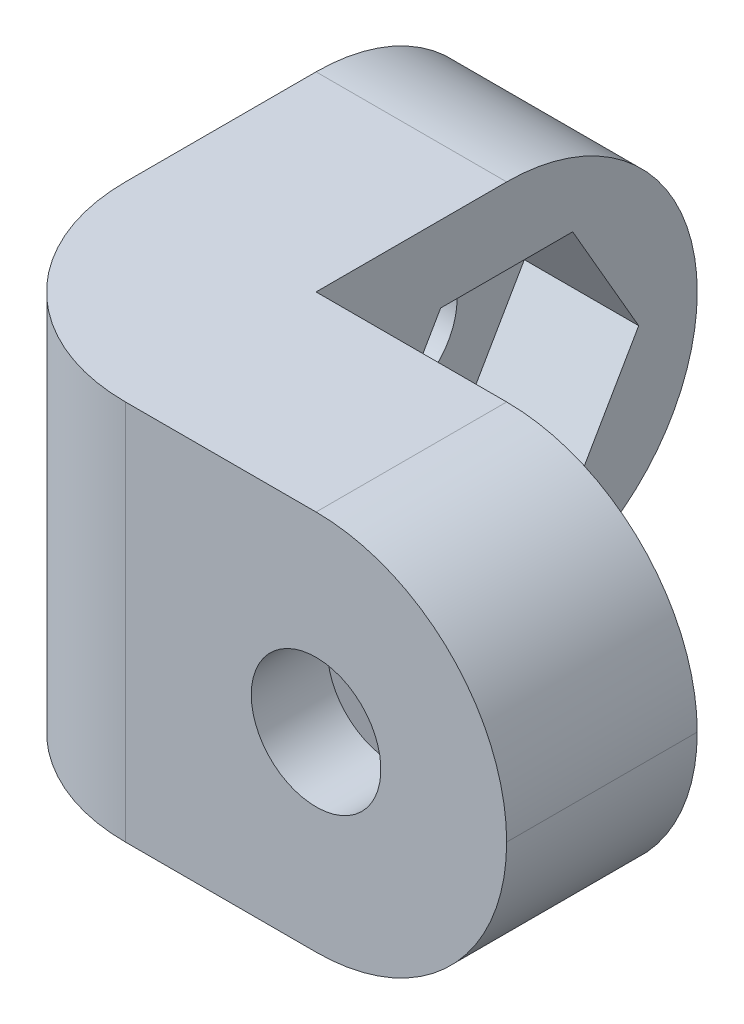
ISO-10303-21;
HEADER;
FILE_DESCRIPTION(('STEP AP214'),'2;1');
FILE_NAME('part.step','',(''),(''),'','','');
FILE_SCHEMA(('AUTOMOTIVE_DESIGN { 1 0 10303 214 1 1 1 1 }'));
ENDSEC;
DATA;
#1=APPLICATION_CONTEXT('core data for automotive mechanical design processes');
#2=APPLICATION_PROTOCOL_DEFINITION('international standard','automotive_design',2000,#1);
#3=PRODUCT_CONTEXT('',#1,'mechanical');
#4=PRODUCT('Part','Part','',(#3));
#5=PRODUCT_RELATED_PRODUCT_CATEGORY('part','',(#4));
#6=PRODUCT_DEFINITION_FORMATION('','',#4);
#7=PRODUCT_DEFINITION_CONTEXT('part definition',#1,'design');
#8=PRODUCT_DEFINITION('design','',#6,#7);
#9=PRODUCT_DEFINITION_SHAPE('','',#8);
#10=(LENGTH_UNIT() NAMED_UNIT(*) SI_UNIT(.MILLI.,.METRE.));
#11=(NAMED_UNIT(*) PLANE_ANGLE_UNIT() SI_UNIT($,.RADIAN.));
#12=(NAMED_UNIT(*) SI_UNIT($,.STERADIAN.) SOLID_ANGLE_UNIT());
#13=UNCERTAINTY_MEASURE_WITH_UNIT(LENGTH_MEASURE(1.E-05),#10,'distance_accuracy_value','');
#14=(GEOMETRIC_REPRESENTATION_CONTEXT(3) GLOBAL_UNCERTAINTY_ASSIGNED_CONTEXT((#13)) GLOBAL_UNIT_ASSIGNED_CONTEXT((#10,
#11,#12)) REPRESENTATION_CONTEXT('',''));
#15=CARTESIAN_POINT('',(0.,0.,0.));
#16=DIRECTION('',(0.,0.,1.));
#17=DIRECTION('',(1.,0.,0.));
#18=AXIS2_PLACEMENT_3D('',#15,#16,#17);
#19=CARTESIAN_POINT('',(10.,5.,0.));
#20=DIRECTION('',(0.,0.,-1.));
#21=DIRECTION('',(-1.,0.,0.));
#22=AXIS2_PLACEMENT_3D('',#19,#20,#21);
#23=CYLINDRICAL_SURFACE('',#22,1.7);
#24=CARTESIAN_POINT('',(10.,5.,0.));
#25=DIRECTION('',(0.,0.,-1.));
#26=DIRECTION('',(-1.,0.,0.));
#27=AXIS2_PLACEMENT_3D('',#24,#25,#26);
#28=CIRCLE('',#27,1.7);
#29=CARTESIAN_POINT('',(8.3,5.,0.));
#30=VERTEX_POINT('',#29);
#31=EDGE_CURVE('E290',#30,#30,#28,.T.);
#32=ORIENTED_EDGE('',*,*,#31,.F.);
#33=EDGE_LOOP('',(#32));
#34=FACE_BOUND('',#33,.T.);
#35=CARTESIAN_POINT('',(10.,5.,-2.));
#36=DIRECTION('',(0.,0.,-1.));
#37=DIRECTION('',(-1.,0.,0.));
#38=AXIS2_PLACEMENT_3D('',#35,#36,#37);
#39=CIRCLE('',#38,1.7);
#40=CARTESIAN_POINT('',(8.3,5.,-2.));
#41=VERTEX_POINT('',#40);
#42=EDGE_CURVE('E230',#41,#41,#39,.F.);
#43=ORIENTED_EDGE('',*,*,#42,.F.);
#44=EDGE_LOOP('',(#43));
#45=FACE_BOUND('',#44,.T.);
#46=ADVANCED_FACE('F34',(#34,#45),#23,.F.);
#47=CARTESIAN_POINT('',(0.,5.,-10.));
#48=DIRECTION('',(1.,0.,0.));
#49=DIRECTION('',(0.,0.,-1.));
#50=AXIS2_PLACEMENT_3D('',#47,#48,#49);
#51=CYLINDRICAL_SURFACE('',#50,1.7);
#52=CARTESIAN_POINT('',(0.,5.,-10.));
#53=DIRECTION('',(1.,0.,0.));
#54=DIRECTION('',(0.,0.,-1.));
#55=AXIS2_PLACEMENT_3D('',#52,#53,#54);
#56=CIRCLE('',#55,1.7);
#57=CARTESIAN_POINT('',(0.,5.,-11.7));
#58=VERTEX_POINT('',#57);
#59=EDGE_CURVE('E287',#58,#58,#56,.T.);
#60=ORIENTED_EDGE('',*,*,#59,.F.);
#61=EDGE_LOOP('',(#60));
#62=FACE_BOUND('',#61,.T.);
#63=CARTESIAN_POINT('',(2.,5.,-10.));
#64=DIRECTION('',(1.,0.,0.));
#65=DIRECTION('',(0.,0.,-1.));
#66=AXIS2_PLACEMENT_3D('',#63,#64,#65);
#67=CIRCLE('',#66,1.7);
#68=CARTESIAN_POINT('',(2.,5.,-11.7));
#69=VERTEX_POINT('',#68);
#70=EDGE_CURVE('E276',#69,#69,#67,.F.);
#71=ORIENTED_EDGE('',*,*,#70,.F.);
#72=EDGE_LOOP('',(#71));
#73=FACE_BOUND('',#72,.T.);
#74=ADVANCED_FACE('F402',(#62,#73),#51,.F.);
#75=CARTESIAN_POINT('',(0.,10.,0.));
#76=DIRECTION('',(0.,0.,-1.));
#77=DIRECTION('',(-1.,0.,0.));
#78=AXIS2_PLACEMENT_3D('',#75,#76,#77);
#79=PLANE('',#78);
#80=ORIENTED_EDGE('',*,*,#31,.T.);
#81=EDGE_LOOP('',(#80));
#82=FACE_BOUND('',#81,.T.);
#83=DIRECTION('',(1.,0.,0.));
#84=VECTOR('',#83,1.);
#85=CARTESIAN_POINT('',(0.,10.,0.));
#86=LINE('',#85,#84);
#87=CARTESIAN_POINT('',(5.,10.,0.));
#88=VERTEX_POINT('',#87);
#89=CARTESIAN_POINT('',(10.,10.,0.));
#90=VERTEX_POINT('',#89);
#91=EDGE_CURVE('E294',#88,#90,#86,.T.);
#92=ORIENTED_EDGE('',*,*,#91,.F.);
#93=DIRECTION('',(0.,-1.,0.));
#94=VECTOR('',#93,1.);
#95=CARTESIAN_POINT('',(5.,10.,0.));
#96=LINE('',#95,#94);
#97=CARTESIAN_POINT('',(5.,0.,0.));
#98=VERTEX_POINT('',#97);
#99=EDGE_CURVE('E325',#88,#98,#96,.T.);
#100=ORIENTED_EDGE('',*,*,#99,.T.);
#101=DIRECTION('',(1.,0.,0.));
#102=VECTOR('',#101,1.);
#103=CARTESIAN_POINT('',(0.,0.,0.));
#104=LINE('',#103,#102);
#105=CARTESIAN_POINT('',(10.,0.,0.));
#106=VERTEX_POINT('',#105);
#107=EDGE_CURVE('E293',#98,#106,#104,.T.);
#108=ORIENTED_EDGE('',*,*,#107,.T.);
#109=CARTESIAN_POINT('',(10.,5.,0.));
#110=DIRECTION('',(0.,0.,-1.));
#111=DIRECTION('',(-1.,0.,0.));
#112=AXIS2_PLACEMENT_3D('',#109,#110,#111);
#113=CIRCLE('',#112,5.);
#114=CARTESIAN_POINT('',(15.,5.,0.));
#115=VERTEX_POINT('',#114);
#116=EDGE_CURVE('E317',#106,#115,#113,.F.);
#117=ORIENTED_EDGE('',*,*,#116,.T.);
#118=CARTESIAN_POINT('',(10.,5.,0.));
#119=DIRECTION('',(0.,0.,-1.));
#120=DIRECTION('',(-1.,0.,0.));
#121=AXIS2_PLACEMENT_3D('',#118,#119,#120);
#122=CIRCLE('',#121,5.);
#123=EDGE_CURVE('E323',#115,#90,#122,.F.);
#124=ORIENTED_EDGE('',*,*,#123,.T.);
#125=EDGE_LOOP('',(#92,#100,#108,#117,#124));
#126=FACE_BOUND('',#125,.T.);
#127=ADVANCED_FACE('F388',(#82,#126),#79,.F.);
#128=CARTESIAN_POINT('',(15.,10.,-5.));
#129=DIRECTION('',(0.,0.,1.));
#130=DIRECTION('',(1.,0.,0.));
#131=AXIS2_PLACEMENT_3D('',#128,#129,#130);
#132=PLANE('',#131);
#133=DIRECTION('',(0.5,0.866025403784439,0.));
#134=VECTOR('',#133,1.);
#135=CARTESIAN_POINT('',(6.53589838486224,5.,-5.));
#136=LINE('',#135,#134);
#137=CARTESIAN_POINT('',(6.53589838486225,5.,-5.));
#138=VERTEX_POINT('',#137);
#139=CARTESIAN_POINT('',(8.26794919243112,8.,-5.));
#140=VERTEX_POINT('',#139);
#141=EDGE_CURVE('E217',#138,#140,#136,.T.);
#142=ORIENTED_EDGE('',*,*,#141,.F.);
#143=DIRECTION('',(-0.5,0.866025403784439,0.));
#144=VECTOR('',#143,1.);
#145=CARTESIAN_POINT('',(8.26794919243112,2.,-5.));
#146=LINE('',#145,#144);
#147=CARTESIAN_POINT('',(8.26794919243112,2.,-5.));
#148=VERTEX_POINT('',#147);
#149=EDGE_CURVE('E184',#148,#138,#146,.T.);
#150=ORIENTED_EDGE('',*,*,#149,.F.);
#151=DIRECTION('',(-1.,0.,0.));
#152=VECTOR('',#151,1.);
#153=CARTESIAN_POINT('',(11.7320508075689,2.,-5.));
#154=LINE('',#153,#152);
#155=CARTESIAN_POINT('',(11.7320508075689,2.,-5.));
#156=VERTEX_POINT('',#155);
#157=EDGE_CURVE('E203',#156,#148,#154,.T.);
#158=ORIENTED_EDGE('',*,*,#157,.F.);
#159=DIRECTION('',(-0.5,-0.866025403784439,0.));
#160=VECTOR('',#159,1.);
#161=CARTESIAN_POINT('',(13.4641016151378,5.,-5.));
#162=LINE('',#161,#160);
#163=CARTESIAN_POINT('',(13.4641016151378,5.,-5.));
#164=VERTEX_POINT('',#163);
#165=EDGE_CURVE('E206',#164,#156,#162,.T.);
#166=ORIENTED_EDGE('',*,*,#165,.F.);
#167=DIRECTION('',(0.5,-0.866025403784439,0.));
#168=VECTOR('',#167,1.);
#169=CARTESIAN_POINT('',(11.7320508075689,8.,-5.));
#170=LINE('',#169,#168);
#171=CARTESIAN_POINT('',(11.7320508075689,8.,-5.));
#172=VERTEX_POINT('',#171);
#173=EDGE_CURVE('E223',#172,#164,#170,.T.);
#174=ORIENTED_EDGE('',*,*,#173,.F.);
#175=DIRECTION('',(1.,0.,0.));
#176=VECTOR('',#175,1.);
#177=CARTESIAN_POINT('',(8.26794919243112,8.,-5.));
#178=LINE('',#177,#176);
#179=EDGE_CURVE('E220',#140,#172,#178,.T.);
#180=ORIENTED_EDGE('',*,*,#179,.F.);
#181=EDGE_LOOP('',(#142,#150,#158,#166,#174,#180));
#182=FACE_BOUND('',#181,.T.);
#183=DIRECTION('',(-1.,0.,0.));
#184=VECTOR('',#183,1.);
#185=CARTESIAN_POINT('',(15.,10.,-5.));
#186=LINE('',#185,#184);
#187=CARTESIAN_POINT('',(10.,10.,-5.));
#188=VERTEX_POINT('',#187);
#189=CARTESIAN_POINT('',(5.,10.,-5.));
#190=VERTEX_POINT('',#189);
#191=EDGE_CURVE('E297',#188,#190,#186,.T.);
#192=ORIENTED_EDGE('',*,*,#191,.F.);
#193=CARTESIAN_POINT('',(10.,5.,-5.));
#194=DIRECTION('',(0.,0.,1.));
#195=DIRECTION('',(1.,0.,0.));
#196=AXIS2_PLACEMENT_3D('',#193,#194,#195);
#197=CIRCLE('',#196,5.);
#198=CARTESIAN_POINT('',(15.,5.,-5.));
#199=VERTEX_POINT('',#198);
#200=EDGE_CURVE('E57',#188,#199,#197,.F.);
#201=ORIENTED_EDGE('',*,*,#200,.T.);
#202=CARTESIAN_POINT('',(10.,5.,-5.));
#203=DIRECTION('',(0.,0.,1.));
#204=DIRECTION('',(1.,0.,0.));
#205=AXIS2_PLACEMENT_3D('',#202,#203,#204);
#206=CIRCLE('',#205,5.);
#207=CARTESIAN_POINT('',(10.,0.,-5.));
#208=VERTEX_POINT('',#207);
#209=EDGE_CURVE('E348',#199,#208,#206,.F.);
#210=ORIENTED_EDGE('',*,*,#209,.T.);
#211=DIRECTION('',(-1.,0.,0.));
#212=VECTOR('',#211,1.);
#213=CARTESIAN_POINT('',(15.,0.,-5.));
#214=LINE('',#213,#212);
#215=CARTESIAN_POINT('',(5.,0.,-5.));
#216=VERTEX_POINT('',#215);
#217=EDGE_CURVE('E309',#208,#216,#214,.T.);
#218=ORIENTED_EDGE('',*,*,#217,.T.);
#219=DIRECTION('',(0.,-1.,0.));
#220=VECTOR('',#219,1.);
#221=CARTESIAN_POINT('',(5.,10.,-5.));
#222=LINE('',#221,#220);
#223=EDGE_CURVE('E306',#190,#216,#222,.T.);
#224=ORIENTED_EDGE('',*,*,#223,.F.);
#225=EDGE_LOOP('',(#192,#201,#210,#218,#224));
#226=FACE_BOUND('',#225,.T.);
#227=ADVANCED_FACE('F371',(#182,#226),#132,.F.);
#228=CARTESIAN_POINT('',(5.,10.,-5.));
#229=DIRECTION('',(-1.,0.,0.));
#230=DIRECTION('',(0.,0.,1.));
#231=AXIS2_PLACEMENT_3D('',#228,#229,#230);
#232=PLANE('',#231);
#233=DIRECTION('',(0.,0.866025403784439,0.5));
#234=VECTOR('',#233,1.);
#235=CARTESIAN_POINT('',(5.,5.,-13.4641016151378));
#236=LINE('',#235,#234);
#237=CARTESIAN_POINT('',(5.,5.,-13.4641016151378));
#238=VERTEX_POINT('',#237);
#239=CARTESIAN_POINT('',(5.,8.,-11.7320508075689));
#240=VERTEX_POINT('',#239);
#241=EDGE_CURVE('E260',#238,#240,#236,.T.);
#242=ORIENTED_EDGE('',*,*,#241,.F.);
#243=DIRECTION('',(0.,0.866025403784439,-0.5));
#244=VECTOR('',#243,1.);
#245=CARTESIAN_POINT('',(5.,2.,-11.7320508075689));
#246=LINE('',#245,#244);
#247=CARTESIAN_POINT('',(5.,2.,-11.7320508075689));
#248=VERTEX_POINT('',#247);
#249=EDGE_CURVE('E258',#248,#238,#246,.T.);
#250=ORIENTED_EDGE('',*,*,#249,.F.);
#251=DIRECTION('',(0.,0.,-1.));
#252=VECTOR('',#251,1.);
#253=CARTESIAN_POINT('',(5.,2.,-8.26794919243112));
#254=LINE('',#253,#252);
#255=CARTESIAN_POINT('',(5.,2.,-8.26794919243112));
#256=VERTEX_POINT('',#255);
#257=EDGE_CURVE('E242',#256,#248,#254,.T.);
#258=ORIENTED_EDGE('',*,*,#257,.F.);
#259=DIRECTION('',(0.,-0.866025403784439,-0.5));
#260=VECTOR('',#259,1.);
#261=CARTESIAN_POINT('',(5.,5.,-6.53589838486225));
#262=LINE('',#261,#260);
#263=CARTESIAN_POINT('',(5.,5.,-6.53589838486225));
#264=VERTEX_POINT('',#263);
#265=EDGE_CURVE('E269',#264,#256,#262,.T.);
#266=ORIENTED_EDGE('',*,*,#265,.F.);
#267=DIRECTION('',(0.,-0.866025403784439,0.5));
#268=VECTOR('',#267,1.);
#269=CARTESIAN_POINT('',(5.,8.,-8.26794919243112));
#270=LINE('',#269,#268);
#271=CARTESIAN_POINT('',(5.,8.,-8.26794919243112));
#272=VERTEX_POINT('',#271);
#273=EDGE_CURVE('E266',#272,#264,#270,.T.);
#274=ORIENTED_EDGE('',*,*,#273,.F.);
#275=DIRECTION('',(0.,0.,1.));
#276=VECTOR('',#275,1.);
#277=CARTESIAN_POINT('',(5.,8.,-11.7320508075689));
#278=LINE('',#277,#276);
#279=EDGE_CURVE('E263',#240,#272,#278,.T.);
#280=ORIENTED_EDGE('',*,*,#279,.F.);
#281=EDGE_LOOP('',(#242,#250,#258,#266,#274,#280));
#282=FACE_BOUND('',#281,.T.);
#283=DIRECTION('',(0.,0.,-1.));
#284=VECTOR('',#283,1.);
#285=CARTESIAN_POINT('',(5.,0.,-5.));
#286=LINE('',#285,#284);
#287=CARTESIAN_POINT('',(5.,0.,-10.));
#288=VERTEX_POINT('',#287);
#289=EDGE_CURVE('E311',#216,#288,#286,.T.);
#290=ORIENTED_EDGE('',*,*,#289,.T.);
#291=CARTESIAN_POINT('',(5.,5.,-10.));
#292=DIRECTION('',(-1.,0.,0.));
#293=DIRECTION('',(0.,0.,1.));
#294=AXIS2_PLACEMENT_3D('',#291,#292,#293);
#295=CIRCLE('',#294,5.);
#296=CARTESIAN_POINT('',(5.,5.,-15.));
#297=VERTEX_POINT('',#296);
#298=EDGE_CURVE('E11',#288,#297,#295,.F.);
#299=ORIENTED_EDGE('',*,*,#298,.T.);
#300=CARTESIAN_POINT('',(5.,5.,-10.));
#301=DIRECTION('',(-1.,0.,0.));
#302=DIRECTION('',(0.,0.,1.));
#303=AXIS2_PLACEMENT_3D('',#300,#301,#302);
#304=CIRCLE('',#303,5.);
#305=CARTESIAN_POINT('',(5.,10.,-10.));
#306=VERTEX_POINT('',#305);
#307=EDGE_CURVE('E43',#297,#306,#304,.F.);
#308=ORIENTED_EDGE('',*,*,#307,.T.);
#309=DIRECTION('',(0.,0.,-1.));
#310=VECTOR('',#309,1.);
#311=CARTESIAN_POINT('',(5.,10.,-5.));
#312=LINE('',#311,#310);
#313=EDGE_CURVE('E300',#190,#306,#312,.T.);
#314=ORIENTED_EDGE('',*,*,#313,.F.);
#315=ORIENTED_EDGE('',*,*,#223,.T.);
#316=EDGE_LOOP('',(#290,#299,#308,#314,#315));
#317=FACE_BOUND('',#316,.T.);
#318=ADVANCED_FACE('F365',(#282,#317),#232,.F.);
#319=CARTESIAN_POINT('',(0.,10.,0.));
#320=DIRECTION('',(1.,0.,0.));
#321=DIRECTION('',(0.,0.,-1.));
#322=AXIS2_PLACEMENT_3D('',#319,#320,#321);
#323=PLANE('',#322);
#324=ORIENTED_EDGE('',*,*,#59,.T.);
#325=EDGE_LOOP('',(#324));
#326=FACE_BOUND('',#325,.T.);
#327=DIRECTION('',(0.,0.,1.));
#328=VECTOR('',#327,1.);
#329=CARTESIAN_POINT('',(0.,0.,0.));
#330=LINE('',#329,#328);
#331=CARTESIAN_POINT('',(0.,0.,-10.));
#332=VERTEX_POINT('',#331);
#333=CARTESIAN_POINT('',(0.,0.,-5.));
#334=VERTEX_POINT('',#333);
#335=EDGE_CURVE('E298',#332,#334,#330,.T.);
#336=ORIENTED_EDGE('',*,*,#335,.T.);
#337=DIRECTION('',(0.,-1.,0.));
#338=VECTOR('',#337,1.);
#339=CARTESIAN_POINT('',(0.,10.,-5.));
#340=LINE('',#339,#338);
#341=CARTESIAN_POINT('',(0.,10.,-5.));
#342=VERTEX_POINT('',#341);
#343=EDGE_CURVE('E339',#334,#342,#340,.F.);
#344=ORIENTED_EDGE('',*,*,#343,.T.);
#345=DIRECTION('',(0.,0.,1.));
#346=VECTOR('',#345,1.);
#347=CARTESIAN_POINT('',(0.,10.,0.));
#348=LINE('',#347,#346);
#349=CARTESIAN_POINT('',(0.,10.,-10.));
#350=VERTEX_POINT('',#349);
#351=EDGE_CURVE('E303',#350,#342,#348,.T.);
#352=ORIENTED_EDGE('',*,*,#351,.F.);
#353=CARTESIAN_POINT('',(0.,5.,-10.));
#354=DIRECTION('',(1.,0.,0.));
#355=DIRECTION('',(0.,0.,-1.));
#356=AXIS2_PLACEMENT_3D('',#353,#354,#355);
#357=CIRCLE('',#356,5.);
#358=CARTESIAN_POINT('',(0.,5.,-15.));
#359=VERTEX_POINT('',#358);
#360=EDGE_CURVE('E335',#350,#359,#357,.F.);
#361=ORIENTED_EDGE('',*,*,#360,.T.);
#362=CARTESIAN_POINT('',(0.,5.,-10.));
#363=DIRECTION('',(1.,0.,0.));
#364=DIRECTION('',(0.,0.,-1.));
#365=AXIS2_PLACEMENT_3D('',#362,#363,#364);
#366=CIRCLE('',#365,5.);
#367=EDGE_CURVE('E337',#359,#332,#366,.F.);
#368=ORIENTED_EDGE('',*,*,#367,.T.);
#369=EDGE_LOOP('',(#336,#344,#352,#361,#368));
#370=FACE_BOUND('',#369,.T.);
#371=ADVANCED_FACE('F381',(#326,#370),#323,.F.);
#372=CARTESIAN_POINT('',(0.,10.,0.));
#373=DIRECTION('',(0.,1.,0.));
#374=DIRECTION('',(0.,0.,1.));
#375=AXIS2_PLACEMENT_3D('',#372,#373,#374);
#376=PLANE('',#375);
#377=ORIENTED_EDGE('',*,*,#351,.T.);
#378=CARTESIAN_POINT('',(5.,10.,-5.));
#379=DIRECTION('',(0.,1.,0.));
#380=DIRECTION('',(0.,0.,1.));
#381=AXIS2_PLACEMENT_3D('',#378,#379,#380);
#382=CIRCLE('',#381,5.);
#383=EDGE_CURVE('E346',#342,#88,#382,.T.);
#384=ORIENTED_EDGE('',*,*,#383,.T.);
#385=ORIENTED_EDGE('',*,*,#91,.T.);
#386=DIRECTION('',(0.,0.,-1.));
#387=VECTOR('',#386,1.);
#388=CARTESIAN_POINT('',(10.,10.,-5.));
#389=LINE('',#388,#387);
#390=EDGE_CURVE('E343',#90,#188,#389,.T.);
#391=ORIENTED_EDGE('',*,*,#390,.T.);
#392=ORIENTED_EDGE('',*,*,#191,.T.);
#393=ORIENTED_EDGE('',*,*,#313,.T.);
#394=DIRECTION('',(-1.,0.,0.));
#395=VECTOR('',#394,1.);
#396=CARTESIAN_POINT('',(0.,10.,-10.));
#397=LINE('',#396,#395);
#398=EDGE_CURVE('E341',#306,#350,#397,.T.);
#399=ORIENTED_EDGE('',*,*,#398,.T.);
#400=EDGE_LOOP('',(#377,#384,#385,#391,#392,#393,#399));
#401=FACE_BOUND('',#400,.T.);
#402=ADVANCED_FACE('F367',(#401),#376,.T.);
#403=CARTESIAN_POINT('',(0.,0.,0.));
#404=DIRECTION('',(0.,1.,0.));
#405=DIRECTION('',(0.,0.,1.));
#406=AXIS2_PLACEMENT_3D('',#403,#404,#405);
#407=PLANE('',#406);
#408=ORIENTED_EDGE('',*,*,#107,.F.);
#409=CARTESIAN_POINT('',(5.,0.,-5.));
#410=DIRECTION('',(0.,1.,0.));
#411=DIRECTION('',(0.,0.,1.));
#412=AXIS2_PLACEMENT_3D('',#409,#410,#411);
#413=CIRCLE('',#412,5.);
#414=EDGE_CURVE('E333',#98,#334,#413,.F.);
#415=ORIENTED_EDGE('',*,*,#414,.T.);
#416=ORIENTED_EDGE('',*,*,#335,.F.);
#417=DIRECTION('',(-1.,0.,0.));
#418=VECTOR('',#417,1.);
#419=CARTESIAN_POINT('',(0.,0.,-10.));
#420=LINE('',#419,#418);
#421=EDGE_CURVE('E328',#332,#288,#420,.F.);
#422=ORIENTED_EDGE('',*,*,#421,.T.);
#423=ORIENTED_EDGE('',*,*,#289,.F.);
#424=ORIENTED_EDGE('',*,*,#217,.F.);
#425=DIRECTION('',(0.,0.,-1.));
#426=VECTOR('',#425,1.);
#427=CARTESIAN_POINT('',(10.,0.,0.));
#428=LINE('',#427,#426);
#429=EDGE_CURVE('E331',#208,#106,#428,.F.);
#430=ORIENTED_EDGE('',*,*,#429,.T.);
#431=EDGE_LOOP('',(#408,#415,#416,#422,#423,#424,#430));
#432=FACE_BOUND('',#431,.T.);
#433=ADVANCED_FACE('F376',(#432),#407,.F.);
#434=CARTESIAN_POINT('',(2.,0.,0.));
#435=DIRECTION('',(1.,0.,0.));
#436=DIRECTION('',(0.,0.,-1.));
#437=AXIS2_PLACEMENT_3D('',#434,#435,#436);
#438=PLANE('',#437);
#439=DIRECTION('',(0.,0.866025403784439,-0.5));
#440=VECTOR('',#439,1.);
#441=CARTESIAN_POINT('',(2.,2.,-11.7320508075689));
#442=LINE('',#441,#440);
#443=CARTESIAN_POINT('',(2.,2.,-11.7320508075689));
#444=VERTEX_POINT('',#443);
#445=CARTESIAN_POINT('',(2.,5.,-13.4641016151378));
#446=VERTEX_POINT('',#445);
#447=EDGE_CURVE('E238',#444,#446,#442,.T.);
#448=ORIENTED_EDGE('',*,*,#447,.T.);
#449=DIRECTION('',(0.,0.866025403784439,0.5));
#450=VECTOR('',#449,1.);
#451=CARTESIAN_POINT('',(2.,5.,-13.4641016151378));
#452=LINE('',#451,#450);
#453=CARTESIAN_POINT('',(2.,8.,-11.7320508075689));
#454=VERTEX_POINT('',#453);
#455=EDGE_CURVE('E241',#446,#454,#452,.T.);
#456=ORIENTED_EDGE('',*,*,#455,.T.);
#457=DIRECTION('',(0.,0.,1.));
#458=VECTOR('',#457,1.);
#459=CARTESIAN_POINT('',(2.,8.,-11.7320508075689));
#460=LINE('',#459,#458);
#461=CARTESIAN_POINT('',(2.,8.,-8.26794919243112));
#462=VERTEX_POINT('',#461);
#463=EDGE_CURVE('E245',#454,#462,#460,.T.);
#464=ORIENTED_EDGE('',*,*,#463,.T.);
#465=DIRECTION('',(0.,-0.866025403784439,0.5));
#466=VECTOR('',#465,1.);
#467=CARTESIAN_POINT('',(2.,8.,-8.26794919243112));
#468=LINE('',#467,#466);
#469=CARTESIAN_POINT('',(2.,5.,-6.53589838486225));
#470=VERTEX_POINT('',#469);
#471=EDGE_CURVE('E248',#462,#470,#468,.T.);
#472=ORIENTED_EDGE('',*,*,#471,.T.);
#473=DIRECTION('',(0.,-0.866025403784439,-0.5));
#474=VECTOR('',#473,1.);
#475=CARTESIAN_POINT('',(2.,5.,-6.53589838486225));
#476=LINE('',#475,#474);
#477=CARTESIAN_POINT('',(2.,2.,-8.26794919243112));
#478=VERTEX_POINT('',#477);
#479=EDGE_CURVE('E251',#470,#478,#476,.T.);
#480=ORIENTED_EDGE('',*,*,#479,.T.);
#481=DIRECTION('',(0.,0.,-1.));
#482=VECTOR('',#481,1.);
#483=CARTESIAN_POINT('',(2.,2.,-8.26794919243112));
#484=LINE('',#483,#482);
#485=EDGE_CURVE('E254',#478,#444,#484,.T.);
#486=ORIENTED_EDGE('',*,*,#485,.T.);
#487=EDGE_LOOP('',(#448,#456,#464,#472,#480,#486));
#488=FACE_BOUND('',#487,.T.);
#489=ORIENTED_EDGE('',*,*,#70,.T.);
#490=EDGE_LOOP('',(#489));
#491=FACE_BOUND('',#490,.T.);
#492=ADVANCED_FACE('F418',(#488,#491),#438,.T.);
#493=CARTESIAN_POINT('',(2.,2.,-11.7320508075689));
#494=DIRECTION('',(0.,-0.5,-0.866025403784439));
#495=DIRECTION('',(0.,0.866025403784439,-0.5));
#496=AXIS2_PLACEMENT_3D('',#493,#494,#495);
#497=PLANE('',#496);
#498=ORIENTED_EDGE('',*,*,#249,.T.);
#499=DIRECTION('',(1.,0.,0.));
#500=VECTOR('',#499,1.);
#501=CARTESIAN_POINT('',(2.,5.,-13.4641016151378));
#502=LINE('',#501,#500);
#503=EDGE_CURVE('E257',#446,#238,#502,.T.);
#504=ORIENTED_EDGE('',*,*,#503,.F.);
#505=ORIENTED_EDGE('',*,*,#447,.F.);
#506=DIRECTION('',(1.,0.,0.));
#507=VECTOR('',#506,1.);
#508=CARTESIAN_POINT('',(2.,2.,-11.7320508075689));
#509=LINE('',#508,#507);
#510=EDGE_CURVE('E274',#444,#248,#509,.T.);
#511=ORIENTED_EDGE('',*,*,#510,.T.);
#512=EDGE_LOOP('',(#498,#504,#505,#511));
#513=FACE_BOUND('',#512,.T.);
#514=ADVANCED_FACE('F449',(#513),#497,.F.);
#515=CARTESIAN_POINT('',(2.,2.,-8.26794919243112));
#516=DIRECTION('',(0.,-1.,0.));
#517=DIRECTION('',(0.,0.,-1.));
#518=AXIS2_PLACEMENT_3D('',#515,#516,#517);
#519=PLANE('',#518);
#520=ORIENTED_EDGE('',*,*,#257,.T.);
#521=ORIENTED_EDGE('',*,*,#510,.F.);
#522=ORIENTED_EDGE('',*,*,#485,.F.);
#523=DIRECTION('',(1.,0.,0.));
#524=VECTOR('',#523,1.);
#525=CARTESIAN_POINT('',(2.,2.,-8.26794919243112));
#526=LINE('',#525,#524);
#527=EDGE_CURVE('E277',#478,#256,#526,.T.);
#528=ORIENTED_EDGE('',*,*,#527,.T.);
#529=EDGE_LOOP('',(#520,#521,#522,#528));
#530=FACE_BOUND('',#529,.T.);
#531=ADVANCED_FACE('F451',(#530),#519,.F.);
#532=CARTESIAN_POINT('',(2.,5.,-6.53589838486225));
#533=DIRECTION('',(0.,-0.5,0.866025403784439));
#534=DIRECTION('',(0.,-0.866025403784439,-0.5));
#535=AXIS2_PLACEMENT_3D('',#532,#533,#534);
#536=PLANE('',#535);
#537=ORIENTED_EDGE('',*,*,#265,.T.);
#538=ORIENTED_EDGE('',*,*,#527,.F.);
#539=ORIENTED_EDGE('',*,*,#479,.F.);
#540=DIRECTION('',(1.,0.,0.));
#541=VECTOR('',#540,1.);
#542=CARTESIAN_POINT('',(2.,5.,-6.53589838486225));
#543=LINE('',#542,#541);
#544=EDGE_CURVE('E279',#470,#264,#543,.T.);
#545=ORIENTED_EDGE('',*,*,#544,.T.);
#546=EDGE_LOOP('',(#537,#538,#539,#545));
#547=FACE_BOUND('',#546,.T.);
#548=ADVANCED_FACE('F454',(#547),#536,.F.);
#549=CARTESIAN_POINT('',(2.,8.,-8.26794919243112));
#550=DIRECTION('',(0.,0.5,0.866025403784439));
#551=DIRECTION('',(0.,-0.866025403784439,0.5));
#552=AXIS2_PLACEMENT_3D('',#549,#550,#551);
#553=PLANE('',#552);
#554=ORIENTED_EDGE('',*,*,#273,.T.);
#555=ORIENTED_EDGE('',*,*,#544,.F.);
#556=ORIENTED_EDGE('',*,*,#471,.F.);
#557=DIRECTION('',(1.,0.,0.));
#558=VECTOR('',#557,1.);
#559=CARTESIAN_POINT('',(2.,8.,-8.26794919243112));
#560=LINE('',#559,#558);
#561=EDGE_CURVE('E281',#462,#272,#560,.T.);
#562=ORIENTED_EDGE('',*,*,#561,.T.);
#563=EDGE_LOOP('',(#554,#555,#556,#562));
#564=FACE_BOUND('',#563,.T.);
#565=ADVANCED_FACE('F458',(#564),#553,.F.);
#566=CARTESIAN_POINT('',(2.,8.,-11.7320508075689));
#567=DIRECTION('',(0.,1.,0.));
#568=DIRECTION('',(0.,0.,1.));
#569=AXIS2_PLACEMENT_3D('',#566,#567,#568);
#570=PLANE('',#569);
#571=ORIENTED_EDGE('',*,*,#279,.T.);
#572=ORIENTED_EDGE('',*,*,#561,.F.);
#573=ORIENTED_EDGE('',*,*,#463,.F.);
#574=DIRECTION('',(1.,0.,0.));
#575=VECTOR('',#574,1.);
#576=CARTESIAN_POINT('',(2.,8.,-11.7320508075689));
#577=LINE('',#576,#575);
#578=EDGE_CURVE('E283',#454,#240,#577,.T.);
#579=ORIENTED_EDGE('',*,*,#578,.T.);
#580=EDGE_LOOP('',(#571,#572,#573,#579));
#581=FACE_BOUND('',#580,.T.);
#582=ADVANCED_FACE('F462',(#581),#570,.F.);
#583=CARTESIAN_POINT('',(2.,5.,-13.4641016151378));
#584=DIRECTION('',(0.,0.5,-0.866025403784439));
#585=DIRECTION('',(0.,0.866025403784439,0.5));
#586=AXIS2_PLACEMENT_3D('',#583,#584,#585);
#587=PLANE('',#586);
#588=ORIENTED_EDGE('',*,*,#241,.T.);
#589=ORIENTED_EDGE('',*,*,#578,.F.);
#590=ORIENTED_EDGE('',*,*,#455,.F.);
#591=ORIENTED_EDGE('',*,*,#503,.T.);
#592=EDGE_LOOP('',(#588,#589,#590,#591));
#593=FACE_BOUND('',#592,.T.);
#594=ADVANCED_FACE('F466',(#593),#587,.F.);
#595=CARTESIAN_POINT('',(0.,0.,-2.));
#596=DIRECTION('',(0.,0.,-1.));
#597=DIRECTION('',(-1.,0.,0.));
#598=AXIS2_PLACEMENT_3D('',#595,#596,#597);
#599=PLANE('',#598);
#600=DIRECTION('',(-0.5,0.866025403784439,0.));
#601=VECTOR('',#600,1.);
#602=CARTESIAN_POINT('',(8.26794919243112,2.,-2.));
#603=LINE('',#602,#601);
#604=CARTESIAN_POINT('',(8.26794919243112,2.,-2.));
#605=VERTEX_POINT('',#604);
#606=CARTESIAN_POINT('',(6.53589838486224,5.,-2.));
#607=VERTEX_POINT('',#606);
#608=EDGE_CURVE('E181',#605,#607,#603,.T.);
#609=ORIENTED_EDGE('',*,*,#608,.T.);
#610=DIRECTION('',(0.5,0.866025403784439,0.));
#611=VECTOR('',#610,1.);
#612=CARTESIAN_POINT('',(6.53589838486224,5.,-2.));
#613=LINE('',#612,#611);
#614=CARTESIAN_POINT('',(8.26794919243112,8.,-2.));
#615=VERTEX_POINT('',#614);
#616=EDGE_CURVE('E192',#607,#615,#613,.T.);
#617=ORIENTED_EDGE('',*,*,#616,.T.);
#618=DIRECTION('',(1.,0.,0.));
#619=VECTOR('',#618,1.);
#620=CARTESIAN_POINT('',(8.26794919243112,8.,-2.));
#621=LINE('',#620,#619);
#622=CARTESIAN_POINT('',(11.7320508075689,8.,-2.));
#623=VERTEX_POINT('',#622);
#624=EDGE_CURVE('E197',#615,#623,#621,.T.);
#625=ORIENTED_EDGE('',*,*,#624,.T.);
#626=DIRECTION('',(0.5,-0.866025403784439,0.));
#627=VECTOR('',#626,1.);
#628=CARTESIAN_POINT('',(11.7320508075689,8.,-2.));
#629=LINE('',#628,#627);
#630=CARTESIAN_POINT('',(13.4641016151378,5.,-2.));
#631=VERTEX_POINT('',#630);
#632=EDGE_CURVE('E210',#623,#631,#629,.T.);
#633=ORIENTED_EDGE('',*,*,#632,.T.);
#634=DIRECTION('',(-0.5,-0.866025403784439,0.));
#635=VECTOR('',#634,1.);
#636=CARTESIAN_POINT('',(13.4641016151378,5.,-2.));
#637=LINE('',#636,#635);
#638=CARTESIAN_POINT('',(11.7320508075689,2.,-2.));
#639=VERTEX_POINT('',#638);
#640=EDGE_CURVE('E213',#631,#639,#637,.T.);
#641=ORIENTED_EDGE('',*,*,#640,.T.);
#642=DIRECTION('',(-1.,0.,0.));
#643=VECTOR('',#642,1.);
#644=CARTESIAN_POINT('',(11.7320508075689,2.,-2.));
#645=LINE('',#644,#643);
#646=EDGE_CURVE('E189',#639,#605,#645,.T.);
#647=ORIENTED_EDGE('',*,*,#646,.T.);
#648=EDGE_LOOP('',(#609,#617,#625,#633,#641,#647));
#649=FACE_BOUND('',#648,.T.);
#650=ORIENTED_EDGE('',*,*,#42,.T.);
#651=EDGE_LOOP('',(#650));
#652=FACE_BOUND('',#651,.T.);
#653=ADVANCED_FACE('F199',(#649,#652),#599,.T.);
#654=CARTESIAN_POINT('',(8.26794919243112,2.,-2.));
#655=DIRECTION('',(-0.866025403784439,-0.5,0.));
#656=DIRECTION('',(0.5,-0.866025403784439,0.));
#657=AXIS2_PLACEMENT_3D('',#654,#655,#656);
#658=PLANE('',#657);
#659=ORIENTED_EDGE('',*,*,#149,.T.);
#660=DIRECTION('',(0.,0.,-1.));
#661=VECTOR('',#660,1.);
#662=CARTESIAN_POINT('',(6.53589838486224,5.,-2.));
#663=LINE('',#662,#661);
#664=EDGE_CURVE('E177',#607,#138,#663,.T.);
#665=ORIENTED_EDGE('',*,*,#664,.F.);
#666=ORIENTED_EDGE('',*,*,#608,.F.);
#667=DIRECTION('',(0.,0.,-1.));
#668=VECTOR('',#667,1.);
#669=CARTESIAN_POINT('',(8.26794919243112,2.,-2.));
#670=LINE('',#669,#668);
#671=EDGE_CURVE('E228',#605,#148,#670,.T.);
#672=ORIENTED_EDGE('',*,*,#671,.T.);
#673=EDGE_LOOP('',(#659,#665,#666,#672));
#674=FACE_BOUND('',#673,.T.);
#675=ADVANCED_FACE('F179',(#674),#658,.F.);
#676=CARTESIAN_POINT('',(11.7320508075689,2.,-2.));
#677=DIRECTION('',(0.,-1.,0.));
#678=DIRECTION('',(0.,0.,-1.));
#679=AXIS2_PLACEMENT_3D('',#676,#677,#678);
#680=PLANE('',#679);
#681=ORIENTED_EDGE('',*,*,#157,.T.);
#682=ORIENTED_EDGE('',*,*,#671,.F.);
#683=ORIENTED_EDGE('',*,*,#646,.F.);
#684=DIRECTION('',(0.,0.,-1.));
#685=VECTOR('',#684,1.);
#686=CARTESIAN_POINT('',(11.7320508075689,2.,-2.));
#687=LINE('',#686,#685);
#688=EDGE_CURVE('E231',#639,#156,#687,.T.);
#689=ORIENTED_EDGE('',*,*,#688,.T.);
#690=EDGE_LOOP('',(#681,#682,#683,#689));
#691=FACE_BOUND('',#690,.T.);
#692=ADVANCED_FACE('F446',(#691),#680,.F.);
#693=CARTESIAN_POINT('',(13.4641016151378,5.,-2.));
#694=DIRECTION('',(0.866025403784439,-0.5,0.));
#695=DIRECTION('',(0.5,0.866025403784439,0.));
#696=AXIS2_PLACEMENT_3D('',#693,#694,#695);
#697=PLANE('',#696);
#698=ORIENTED_EDGE('',*,*,#165,.T.);
#699=ORIENTED_EDGE('',*,*,#688,.F.);
#700=ORIENTED_EDGE('',*,*,#640,.F.);
#701=DIRECTION('',(0.,0.,-1.));
#702=VECTOR('',#701,1.);
#703=CARTESIAN_POINT('',(13.4641016151378,5.,-2.));
#704=LINE('',#703,#702);
#705=EDGE_CURVE('E233',#631,#164,#704,.T.);
#706=ORIENTED_EDGE('',*,*,#705,.T.);
#707=EDGE_LOOP('',(#698,#699,#700,#706));
#708=FACE_BOUND('',#707,.T.);
#709=ADVANCED_FACE('F527',(#708),#697,.F.);
#710=CARTESIAN_POINT('',(11.7320508075689,8.,-2.));
#711=DIRECTION('',(0.866025403784439,0.5,0.));
#712=DIRECTION('',(-0.5,0.866025403784439,0.));
#713=AXIS2_PLACEMENT_3D('',#710,#711,#712);
#714=PLANE('',#713);
#715=ORIENTED_EDGE('',*,*,#173,.T.);
#716=ORIENTED_EDGE('',*,*,#705,.F.);
#717=ORIENTED_EDGE('',*,*,#632,.F.);
#718=DIRECTION('',(0.,0.,-1.));
#719=VECTOR('',#718,1.);
#720=CARTESIAN_POINT('',(11.7320508075689,8.,-2.));
#721=LINE('',#720,#719);
#722=EDGE_CURVE('E235',#623,#172,#721,.T.);
#723=ORIENTED_EDGE('',*,*,#722,.T.);
#724=EDGE_LOOP('',(#715,#716,#717,#723));
#725=FACE_BOUND('',#724,.T.);
#726=ADVANCED_FACE('F439',(#725),#714,.F.);
#727=CARTESIAN_POINT('',(8.26794919243112,8.,-2.));
#728=DIRECTION('',(0.,1.,0.));
#729=DIRECTION('',(0.,0.,1.));
#730=AXIS2_PLACEMENT_3D('',#727,#728,#729);
#731=PLANE('',#730);
#732=ORIENTED_EDGE('',*,*,#179,.T.);
#733=ORIENTED_EDGE('',*,*,#722,.F.);
#734=ORIENTED_EDGE('',*,*,#624,.F.);
#735=DIRECTION('',(0.,0.,-1.));
#736=VECTOR('',#735,1.);
#737=CARTESIAN_POINT('',(8.26794919243112,8.,-2.));
#738=LINE('',#737,#736);
#739=EDGE_CURVE('E188',#615,#140,#738,.T.);
#740=ORIENTED_EDGE('',*,*,#739,.T.);
#741=EDGE_LOOP('',(#732,#733,#734,#740));
#742=FACE_BOUND('',#741,.T.);
#743=ADVANCED_FACE('F434',(#742),#731,.F.);
#744=CARTESIAN_POINT('',(6.53589838486224,5.,-2.));
#745=DIRECTION('',(-0.866025403784439,0.5,0.));
#746=DIRECTION('',(-0.5,-0.866025403784439,0.));
#747=AXIS2_PLACEMENT_3D('',#744,#745,#746);
#748=PLANE('',#747);
#749=ORIENTED_EDGE('',*,*,#141,.T.);
#750=ORIENTED_EDGE('',*,*,#739,.F.);
#751=ORIENTED_EDGE('',*,*,#616,.F.);
#752=ORIENTED_EDGE('',*,*,#664,.T.);
#753=EDGE_LOOP('',(#749,#750,#751,#752));
#754=FACE_BOUND('',#753,.T.);
#755=ADVANCED_FACE('F193',(#754),#748,.F.);
#756=CARTESIAN_POINT('',(5.,10.,-5.));
#757=DIRECTION('',(0.,-1.,0.));
#758=DIRECTION('',(0.,0.,-1.));
#759=AXIS2_PLACEMENT_3D('',#756,#757,#758);
#760=CYLINDRICAL_SURFACE('',#759,5.);
#761=ORIENTED_EDGE('',*,*,#383,.F.);
#762=ORIENTED_EDGE('',*,*,#343,.F.);
#763=ORIENTED_EDGE('',*,*,#414,.F.);
#764=ORIENTED_EDGE('',*,*,#99,.F.);
#765=EDGE_LOOP('',(#761,#762,#763,#764));
#766=FACE_BOUND('',#765,.T.);
#767=ADVANCED_FACE('F384',(#766),#760,.T.);
#768=CARTESIAN_POINT('',(10.,5.,0.));
#769=DIRECTION('',(0.,0.,-1.));
#770=DIRECTION('',(-1.,0.,0.));
#771=AXIS2_PLACEMENT_3D('',#768,#769,#770);
#772=CYLINDRICAL_SURFACE('',#771,5.);
#773=DIRECTION('',(0.,0.,-1.));
#774=VECTOR('',#773,1.);
#775=CARTESIAN_POINT('',(15.,5.,0.));
#776=LINE('',#775,#774);
#777=EDGE_CURVE('E218',#115,#199,#776,.T.);
#778=ORIENTED_EDGE('',*,*,#777,.F.);
#779=ORIENTED_EDGE('',*,*,#116,.F.);
#780=ORIENTED_EDGE('',*,*,#429,.F.);
#781=ORIENTED_EDGE('',*,*,#209,.F.);
#782=EDGE_LOOP('',(#778,#779,#780,#781));
#783=FACE_BOUND('',#782,.T.);
#784=ADVANCED_FACE('F392',(#783),#772,.T.);
#785=CARTESIAN_POINT('',(10.,5.,0.));
#786=DIRECTION('',(0.,0.,1.));
#787=DIRECTION('',(1.,0.,0.));
#788=AXIS2_PLACEMENT_3D('',#785,#786,#787);
#789=CYLINDRICAL_SURFACE('',#788,5.);
#790=ORIENTED_EDGE('',*,*,#123,.F.);
#791=ORIENTED_EDGE('',*,*,#777,.T.);
#792=ORIENTED_EDGE('',*,*,#200,.F.);
#793=ORIENTED_EDGE('',*,*,#390,.F.);
#794=EDGE_LOOP('',(#790,#791,#792,#793));
#795=FACE_BOUND('',#794,.T.);
#796=ADVANCED_FACE('F390',(#795),#789,.T.);
#797=CARTESIAN_POINT('',(0.,5.,-10.));
#798=DIRECTION('',(1.,0.,0.));
#799=DIRECTION('',(0.,0.,-1.));
#800=AXIS2_PLACEMENT_3D('',#797,#798,#799);
#801=CYLINDRICAL_SURFACE('',#800,5.);
#802=ORIENTED_EDGE('',*,*,#398,.F.);
#803=ORIENTED_EDGE('',*,*,#307,.F.);
#804=DIRECTION('',(-1.,0.,0.));
#805=VECTOR('',#804,1.);
#806=CARTESIAN_POINT('',(5.,5.,-15.));
#807=LINE('',#806,#805);
#808=EDGE_CURVE('E38',#359,#297,#807,.F.);
#809=ORIENTED_EDGE('',*,*,#808,.F.);
#810=ORIENTED_EDGE('',*,*,#360,.F.);
#811=EDGE_LOOP('',(#802,#803,#809,#810));
#812=FACE_BOUND('',#811,.T.);
#813=ADVANCED_FACE('F36',(#812),#801,.T.);
#814=CARTESIAN_POINT('',(5.,5.,-10.));
#815=DIRECTION('',(-1.,0.,0.));
#816=DIRECTION('',(0.,0.,1.));
#817=AXIS2_PLACEMENT_3D('',#814,#815,#816);
#818=CYLINDRICAL_SURFACE('',#817,5.);
#819=ORIENTED_EDGE('',*,*,#298,.F.);
#820=ORIENTED_EDGE('',*,*,#421,.F.);
#821=ORIENTED_EDGE('',*,*,#367,.F.);
#822=ORIENTED_EDGE('',*,*,#808,.T.);
#823=EDGE_LOOP('',(#819,#820,#821,#822));
#824=FACE_BOUND('',#823,.T.);
#825=ADVANCED_FACE('F359',(#824),#818,.T.);
#826=CLOSED_SHELL('',(#46,#74,#127,#227,#318,#371,#402,#433,#492,#514,#531,#548,#565,#582,#594,
#653,#675,#692,#709,#726,#743,#755,#767,#784,#796,#813,#825));
#827=MANIFOLD_SOLID_BREP('B2',#826);
#828=ADVANCED_BREP_SHAPE_REPRESENTATION('',(#18,#827),#14);
#829=SHAPE_DEFINITION_REPRESENTATION(#9,#828);
ENDSEC;
END-ISO-10303-21;
